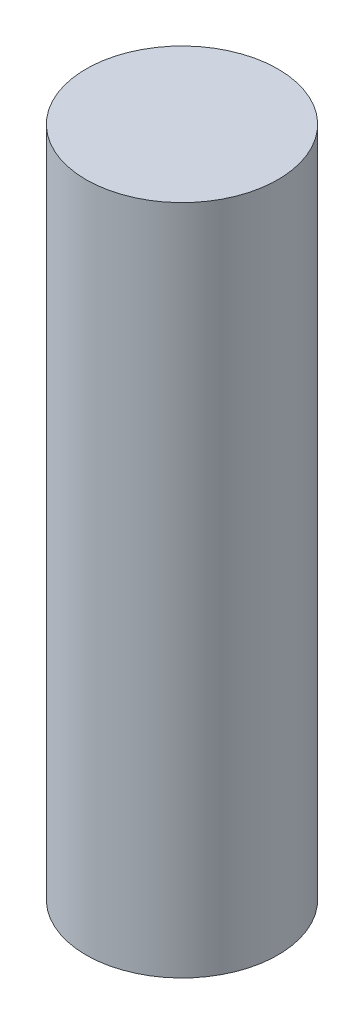
ISO-10303-21;
HEADER;
FILE_DESCRIPTION(('STEP AP214'),'2;1');
FILE_NAME('part.step','',(''),(''),'','','');
FILE_SCHEMA(('AUTOMOTIVE_DESIGN { 1 0 10303 214 1 1 1 1 }'));
ENDSEC;
DATA;
#1=APPLICATION_CONTEXT('core data for automotive mechanical design processes');
#2=APPLICATION_PROTOCOL_DEFINITION('international standard','automotive_design',2000,#1);
#3=PRODUCT_CONTEXT('',#1,'mechanical');
#4=PRODUCT('Part','Part','',(#3));
#5=PRODUCT_RELATED_PRODUCT_CATEGORY('part','',(#4));
#6=PRODUCT_DEFINITION_FORMATION('','',#4);
#7=PRODUCT_DEFINITION_CONTEXT('part definition',#1,'design');
#8=PRODUCT_DEFINITION('design','',#6,#7);
#9=PRODUCT_DEFINITION_SHAPE('','',#8);
#10=(LENGTH_UNIT() NAMED_UNIT(*) SI_UNIT(.MILLI.,.METRE.));
#11=(NAMED_UNIT(*) PLANE_ANGLE_UNIT() SI_UNIT($,.RADIAN.));
#12=(NAMED_UNIT(*) SI_UNIT($,.STERADIAN.) SOLID_ANGLE_UNIT());
#13=UNCERTAINTY_MEASURE_WITH_UNIT(LENGTH_MEASURE(1.E-05),#10,'distance_accuracy_value','');
#14=(GEOMETRIC_REPRESENTATION_CONTEXT(3) GLOBAL_UNCERTAINTY_ASSIGNED_CONTEXT((#13)) GLOBAL_UNIT_ASSIGNED_CONTEXT((#10,
#11,#12)) REPRESENTATION_CONTEXT('',''));
#15=CARTESIAN_POINT('',(0.,0.,0.));
#16=DIRECTION('',(0.,0.,1.));
#17=DIRECTION('',(1.,0.,0.));
#18=AXIS2_PLACEMENT_3D('',#15,#16,#17);
#19=CARTESIAN_POINT('',(0.,14.,0.));
#20=DIRECTION('',(0.,-1.,0.));
#21=DIRECTION('',(0.,0.,-1.));
#22=AXIS2_PLACEMENT_3D('',#19,#20,#21);
#23=CYLINDRICAL_SURFACE('',#22,2.);
#24=CARTESIAN_POINT('',(0.,14.,0.));
#25=DIRECTION('',(0.,1.,0.));
#26=DIRECTION('',(0.,0.,1.));
#27=AXIS2_PLACEMENT_3D('',#24,#25,#26);
#28=CIRCLE('',#27,2.);
#29=CARTESIAN_POINT('',(0.,14.,2.));
#30=VERTEX_POINT('',#29);
#31=EDGE_CURVE('E10',#30,#30,#28,.T.);
#32=ORIENTED_EDGE('',*,*,#31,.F.);
#33=EDGE_LOOP('',(#32));
#34=FACE_BOUND('',#33,.T.);
#35=CARTESIAN_POINT('',(0.,0.,0.));
#36=DIRECTION('',(0.,1.,0.));
#37=DIRECTION('',(0.,0.,1.));
#38=AXIS2_PLACEMENT_3D('',#35,#36,#37);
#39=CIRCLE('',#38,2.);
#40=CARTESIAN_POINT('',(0.,0.,2.));
#41=VERTEX_POINT('',#40);
#42=EDGE_CURVE('E40',#41,#41,#39,.T.);
#43=ORIENTED_EDGE('',*,*,#42,.T.);
#44=EDGE_LOOP('',(#43));
#45=FACE_BOUND('',#44,.T.);
#46=ADVANCED_FACE('F37',(#34,#45),#23,.T.);
#47=CARTESIAN_POINT('',(0.,14.,0.));
#48=DIRECTION('',(0.,1.,0.));
#49=DIRECTION('',(0.,0.,1.));
#50=AXIS2_PLACEMENT_3D('',#47,#48,#49);
#51=PLANE('',#50);
#52=ORIENTED_EDGE('',*,*,#31,.T.);
#53=EDGE_LOOP('',(#52));
#54=FACE_BOUND('',#53,.T.);
#55=ADVANCED_FACE('F54',(#54),#51,.T.);
#56=CARTESIAN_POINT('',(0.,0.,0.));
#57=DIRECTION('',(0.,1.,0.));
#58=DIRECTION('',(0.,0.,1.));
#59=AXIS2_PLACEMENT_3D('',#56,#57,#58);
#60=PLANE('',#59);
#61=ORIENTED_EDGE('',*,*,#42,.F.);
#62=EDGE_LOOP('',(#61));
#63=FACE_BOUND('',#62,.T.);
#64=ADVANCED_FACE('F52',(#63),#60,.F.);
#65=CLOSED_SHELL('',(#46,#55,#64));
#66=MANIFOLD_SOLID_BREP('B2',#65);
#67=ADVANCED_BREP_SHAPE_REPRESENTATION('',(#18,#66),#14);
#68=SHAPE_DEFINITION_REPRESENTATION(#9,#67);
ENDSEC;
END-ISO-10303-21;
